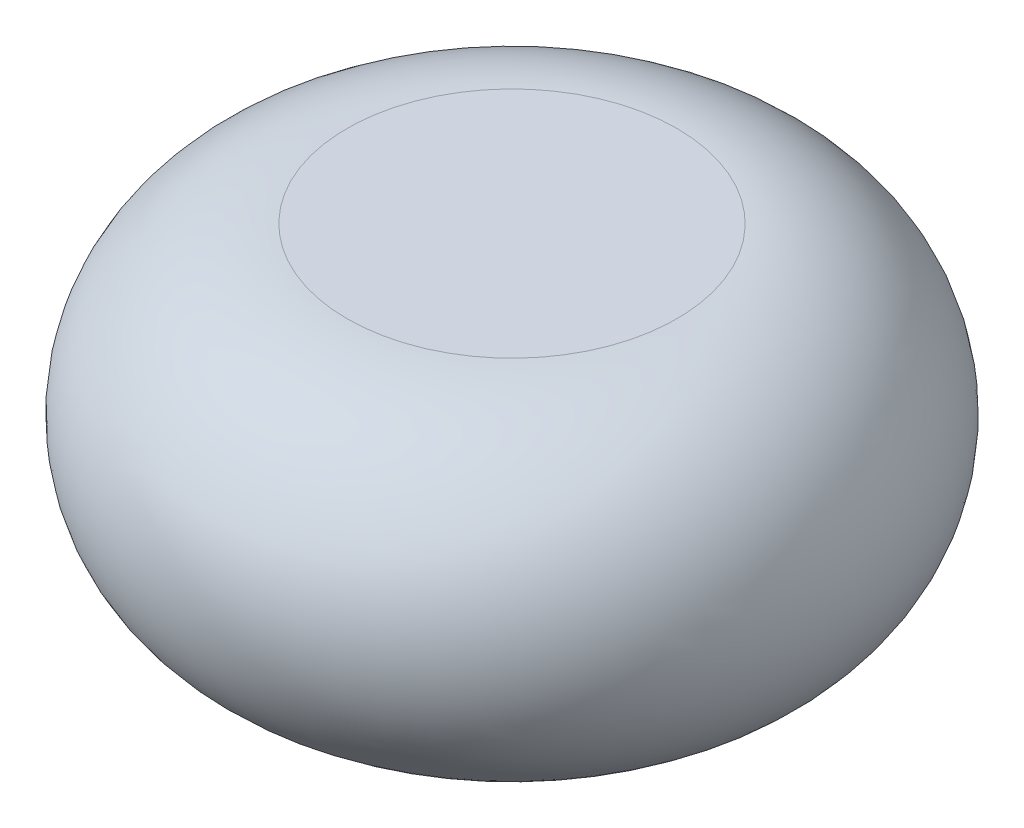
ISO-10303-21;
HEADER;
FILE_DESCRIPTION(('STEP AP214'),'2;1');
FILE_NAME('part.step','',(''),(''),'','','');
FILE_SCHEMA(('AUTOMOTIVE_DESIGN { 1 0 10303 214 1 1 1 1 }'));
ENDSEC;
DATA;
#1=APPLICATION_CONTEXT('core data for automotive mechanical design processes');
#2=APPLICATION_PROTOCOL_DEFINITION('international standard','automotive_design',2000,#1);
#3=PRODUCT_CONTEXT('',#1,'mechanical');
#4=PRODUCT('Part','Part','',(#3));
#5=PRODUCT_RELATED_PRODUCT_CATEGORY('part','',(#4));
#6=PRODUCT_DEFINITION_FORMATION('','',#4);
#7=PRODUCT_DEFINITION_CONTEXT('part definition',#1,'design');
#8=PRODUCT_DEFINITION('design','',#6,#7);
#9=PRODUCT_DEFINITION_SHAPE('','',#8);
#10=(LENGTH_UNIT() NAMED_UNIT(*) SI_UNIT(.MILLI.,.METRE.));
#11=(NAMED_UNIT(*) PLANE_ANGLE_UNIT() SI_UNIT($,.RADIAN.));
#12=(NAMED_UNIT(*) SI_UNIT($,.STERADIAN.) SOLID_ANGLE_UNIT());
#13=UNCERTAINTY_MEASURE_WITH_UNIT(LENGTH_MEASURE(1.E-05),#10,'distance_accuracy_value','');
#14=(GEOMETRIC_REPRESENTATION_CONTEXT(3) GLOBAL_UNCERTAINTY_ASSIGNED_CONTEXT((#13)) GLOBAL_UNIT_ASSIGNED_CONTEXT((#10,
#11,#12)) REPRESENTATION_CONTEXT('',''));
#15=CARTESIAN_POINT('',(0.,0.,0.));
#16=DIRECTION('',(0.,0.,1.));
#17=DIRECTION('',(1.,0.,0.));
#18=AXIS2_PLACEMENT_3D('',#15,#16,#17);
#19=CARTESIAN_POINT('',(0.,0.,0.));
#20=DIRECTION('',(0.,1.,0.));
#21=DIRECTION('',(0.,0.,1.));
#22=AXIS2_PLACEMENT_3D('',#19,#20,#21);
#23=TOROIDAL_SURFACE('',#22,500.000000000001,500.);
#24=CARTESIAN_POINT('',(0.,500.,0.));
#25=DIRECTION('',(0.,1.,0.));
#26=DIRECTION('',(0.,0.,1.));
#27=AXIS2_PLACEMENT_3D('',#24,#25,#26);
#28=CIRCLE('',#27,500.000000000001);
#29=CARTESIAN_POINT('',(0.,500.,500.000000000001));
#30=VERTEX_POINT('',#29);
#31=EDGE_CURVE('E10',#30,#30,#28,.T.);
#32=ORIENTED_EDGE('',*,*,#31,.F.);
#33=EDGE_LOOP('',(#32));
#34=FACE_BOUND('',#33,.T.);
#35=CARTESIAN_POINT('',(0.,-500.,0.));
#36=DIRECTION('',(0.,1.,0.));
#37=DIRECTION('',(0.,0.,1.));
#38=AXIS2_PLACEMENT_3D('',#35,#36,#37);
#39=CIRCLE('',#38,500.000000000001);
#40=CARTESIAN_POINT('',(0.,-500.,500.000000000001));
#41=VERTEX_POINT('',#40);
#42=EDGE_CURVE('E45',#41,#41,#39,.T.);
#43=ORIENTED_EDGE('',*,*,#42,.T.);
#44=EDGE_LOOP('',(#43));
#45=FACE_BOUND('',#44,.T.);
#46=ADVANCED_FACE('F39',(#34,#45),#23,.T.);
#47=CARTESIAN_POINT('',(6.66133814775094E-13,500.,0.));
#48=DIRECTION('',(0.,-1.,0.));
#49=DIRECTION('',(0.,0.,-1.));
#50=AXIS2_PLACEMENT_3D('',#47,#48,#49);
#51=PLANE('',#50);
#52=ORIENTED_EDGE('',*,*,#31,.T.);
#53=EDGE_LOOP('',(#52));
#54=FACE_BOUND('',#53,.T.);
#55=ADVANCED_FACE('F54',(#54),#51,.F.);
#56=CARTESIAN_POINT('',(6.66133814775094E-13,-500.,0.));
#57=DIRECTION('',(0.,1.,0.));
#58=DIRECTION('',(0.,0.,1.));
#59=AXIS2_PLACEMENT_3D('',#56,#57,#58);
#60=PLANE('',#59);
#61=ORIENTED_EDGE('',*,*,#42,.F.);
#62=EDGE_LOOP('',(#61));
#63=FACE_BOUND('',#62,.T.);
#64=ADVANCED_FACE('F52',(#63),#60,.F.);
#65=CLOSED_SHELL('',(#46,#55,#64));
#66=MANIFOLD_SOLID_BREP('B2',#65);
#67=ADVANCED_BREP_SHAPE_REPRESENTATION('',(#18,#66),#14);
#68=SHAPE_DEFINITION_REPRESENTATION(#9,#67);
ENDSEC;
END-ISO-10303-21;
